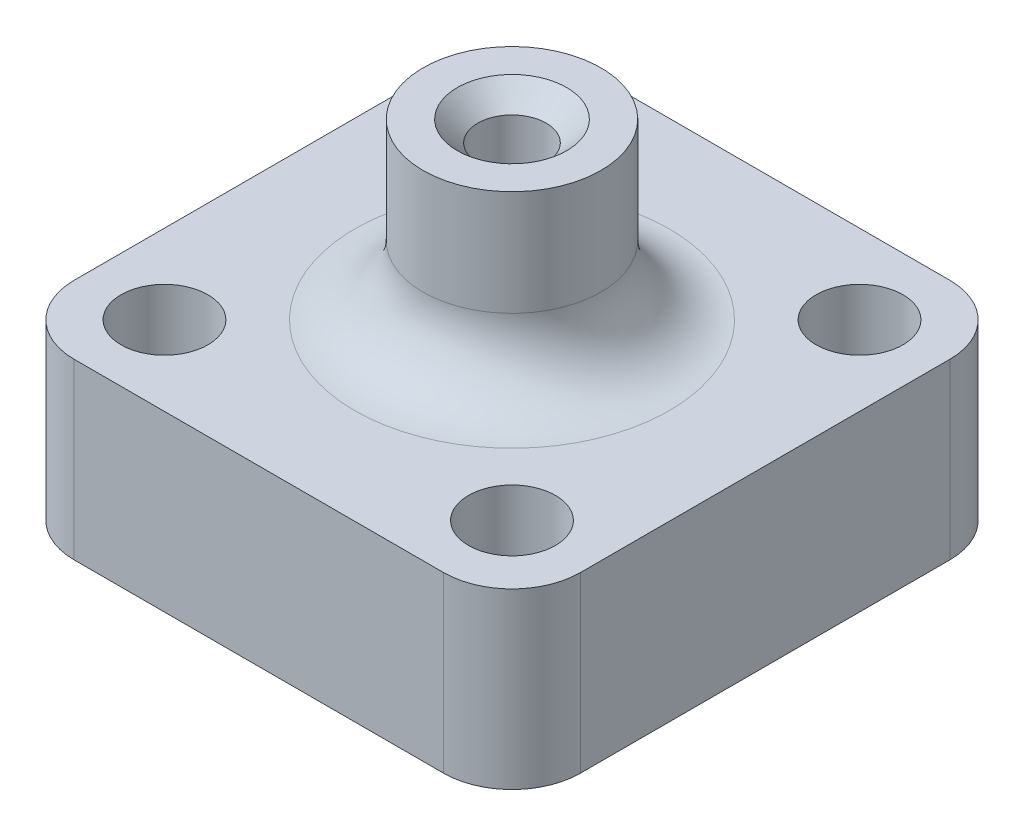
ISO-10303-21;
HEADER;
FILE_DESCRIPTION(('STEP AP214'),'2;1');
FILE_NAME('part.step','',(''),(''),'','','');
FILE_SCHEMA(('AUTOMOTIVE_DESIGN { 1 0 10303 214 1 1 1 1 }'));
ENDSEC;
DATA;
#1=APPLICATION_CONTEXT('core data for automotive mechanical design processes');
#2=APPLICATION_PROTOCOL_DEFINITION('international standard','automotive_design',2000,#1);
#3=PRODUCT_CONTEXT('',#1,'mechanical');
#4=PRODUCT('Part','Part','',(#3));
#5=PRODUCT_RELATED_PRODUCT_CATEGORY('part','',(#4));
#6=PRODUCT_DEFINITION_FORMATION('','',#4);
#7=PRODUCT_DEFINITION_CONTEXT('part definition',#1,'design');
#8=PRODUCT_DEFINITION('design','',#6,#7);
#9=PRODUCT_DEFINITION_SHAPE('','',#8);
#10=(LENGTH_UNIT() NAMED_UNIT(*) SI_UNIT(.MILLI.,.METRE.));
#11=(NAMED_UNIT(*) PLANE_ANGLE_UNIT() SI_UNIT($,.RADIAN.));
#12=(NAMED_UNIT(*) SI_UNIT($,.STERADIAN.) SOLID_ANGLE_UNIT());
#13=UNCERTAINTY_MEASURE_WITH_UNIT(LENGTH_MEASURE(1.E-05),#10,'distance_accuracy_value','');
#14=(GEOMETRIC_REPRESENTATION_CONTEXT(3) GLOBAL_UNCERTAINTY_ASSIGNED_CONTEXT((#13)) GLOBAL_UNIT_ASSIGNED_CONTEXT((#10,
#11,#12)) REPRESENTATION_CONTEXT('',''));
#15=CARTESIAN_POINT('',(0.,0.,0.));
#16=DIRECTION('',(0.,0.,1.));
#17=DIRECTION('',(1.,0.,0.));
#18=AXIS2_PLACEMENT_3D('',#15,#16,#17);
#19=CARTESIAN_POINT('',(0.,12.7,0.));
#20=DIRECTION('',(0.,1.,0.));
#21=DIRECTION('',(0.,0.,1.));
#22=AXIS2_PLACEMENT_3D('',#19,#20,#21);
#23=PLANE('',#22);
#24=CARTESIAN_POINT('',(0.,12.7,0.));
#25=DIRECTION('',(0.,1.,0.));
#26=DIRECTION('',(0.,0.,1.));
#27=AXIS2_PLACEMENT_3D('',#24,#25,#26);
#28=CIRCLE('',#27,11.5);
#29=CARTESIAN_POINT('',(0.,12.7,11.5));
#30=VERTEX_POINT('',#29);
#31=EDGE_CURVE('E144',#30,#30,#28,.F.);
#32=ORIENTED_EDGE('',*,*,#31,.T.);
#33=EDGE_LOOP('',(#32));
#34=FACE_BOUND('',#33,.T.);
#35=CARTESIAN_POINT('',(-12.7,12.7,-12.7));
#36=DIRECTION('',(0.,1.,0.));
#37=DIRECTION('',(0.,0.,1.));
#38=AXIS2_PLACEMENT_3D('',#35,#36,#37);
#39=CIRCLE('',#38,3.175);
#40=CARTESIAN_POINT('',(-12.7,12.7,-9.525));
#41=VERTEX_POINT('',#40);
#42=EDGE_CURVE('E257',#41,#41,#39,.T.);
#43=ORIENTED_EDGE('',*,*,#42,.F.);
#44=EDGE_LOOP('',(#43));
#45=FACE_BOUND('',#44,.T.);
#46=CARTESIAN_POINT('',(12.7,12.7,12.7));
#47=DIRECTION('',(0.,1.,0.));
#48=DIRECTION('',(0.,0.,1.));
#49=AXIS2_PLACEMENT_3D('',#46,#47,#48);
#50=CIRCLE('',#49,3.175);
#51=CARTESIAN_POINT('',(12.7,12.7,15.875));
#52=VERTEX_POINT('',#51);
#53=EDGE_CURVE('E246',#52,#52,#50,.T.);
#54=ORIENTED_EDGE('',*,*,#53,.F.);
#55=EDGE_LOOP('',(#54));
#56=FACE_BOUND('',#55,.T.);
#57=DIRECTION('',(-1.,0.,0.));
#58=VECTOR('',#57,1.);
#59=CARTESIAN_POINT('',(-18.5,12.7,-18.5));
#60=LINE('',#59,#58);
#61=CARTESIAN_POINT('',(13.5,12.7,-18.5));
#62=VERTEX_POINT('',#61);
#63=CARTESIAN_POINT('',(-13.5,12.7,-18.5));
#64=VERTEX_POINT('',#63);
#65=EDGE_CURVE('E228',#62,#64,#60,.T.);
#66=ORIENTED_EDGE('',*,*,#65,.T.);
#67=CARTESIAN_POINT('',(-13.5,12.7,-13.5));
#68=DIRECTION('',(0.,1.,0.));
#69=DIRECTION('',(0.,0.,1.));
#70=AXIS2_PLACEMENT_3D('',#67,#68,#69);
#71=CIRCLE('',#70,5.);
#72=CARTESIAN_POINT('',(-18.5,12.7,-13.5));
#73=VERTEX_POINT('',#72);
#74=EDGE_CURVE('E152',#64,#73,#71,.T.);
#75=ORIENTED_EDGE('',*,*,#74,.T.);
#76=DIRECTION('',(0.,0.,1.));
#77=VECTOR('',#76,1.);
#78=CARTESIAN_POINT('',(-18.5,12.7,-18.5));
#79=LINE('',#78,#77);
#80=CARTESIAN_POINT('',(-18.5,12.7,13.5));
#81=VERTEX_POINT('',#80);
#82=EDGE_CURVE('E119',#73,#81,#79,.T.);
#83=ORIENTED_EDGE('',*,*,#82,.T.);
#84=CARTESIAN_POINT('',(-13.5,12.7,13.5));
#85=DIRECTION('',(0.,1.,0.));
#86=DIRECTION('',(0.,0.,1.));
#87=AXIS2_PLACEMENT_3D('',#84,#85,#86);
#88=CIRCLE('',#87,5.);
#89=CARTESIAN_POINT('',(-13.5,12.7,18.5));
#90=VERTEX_POINT('',#89);
#91=EDGE_CURVE('E55',#81,#90,#88,.T.);
#92=ORIENTED_EDGE('',*,*,#91,.T.);
#93=DIRECTION('',(1.,0.,0.));
#94=VECTOR('',#93,1.);
#95=CARTESIAN_POINT('',(-18.5,12.7,18.5));
#96=LINE('',#95,#94);
#97=CARTESIAN_POINT('',(13.5,12.7,18.5));
#98=VERTEX_POINT('',#97);
#99=EDGE_CURVE('E135',#90,#98,#96,.T.);
#100=ORIENTED_EDGE('',*,*,#99,.T.);
#101=CARTESIAN_POINT('',(13.5,12.7,13.5));
#102=DIRECTION('',(0.,1.,0.));
#103=DIRECTION('',(0.,0.,1.));
#104=AXIS2_PLACEMENT_3D('',#101,#102,#103);
#105=CIRCLE('',#104,5.);
#106=CARTESIAN_POINT('',(18.5,12.7,13.5));
#107=VERTEX_POINT('',#106);
#108=EDGE_CURVE('E148',#98,#107,#105,.T.);
#109=ORIENTED_EDGE('',*,*,#108,.T.);
#110=DIRECTION('',(0.,0.,-1.));
#111=VECTOR('',#110,1.);
#112=CARTESIAN_POINT('',(18.5,12.7,-18.5));
#113=LINE('',#112,#111);
#114=CARTESIAN_POINT('',(18.5,12.7,-13.5));
#115=VERTEX_POINT('',#114);
#116=EDGE_CURVE('E129',#107,#115,#113,.T.);
#117=ORIENTED_EDGE('',*,*,#116,.T.);
#118=CARTESIAN_POINT('',(13.5,12.7,-13.5));
#119=DIRECTION('',(0.,1.,0.));
#120=DIRECTION('',(0.,0.,1.));
#121=AXIS2_PLACEMENT_3D('',#118,#119,#120);
#122=CIRCLE('',#121,5.);
#123=EDGE_CURVE('E150',#115,#62,#122,.T.);
#124=ORIENTED_EDGE('',*,*,#123,.T.);
#125=EDGE_LOOP('',(#66,#75,#83,#92,#100,#109,#117,#124));
#126=FACE_BOUND('',#125,.T.);
#127=CARTESIAN_POINT('',(-12.7,12.7,12.7));
#128=DIRECTION('',(0.,1.,0.));
#129=DIRECTION('',(0.,0.,1.));
#130=AXIS2_PLACEMENT_3D('',#127,#128,#129);
#131=CIRCLE('',#130,3.175);
#132=CARTESIAN_POINT('',(-12.7,12.7,15.875));
#133=VERTEX_POINT('',#132);
#134=EDGE_CURVE('E238',#133,#133,#131,.T.);
#135=ORIENTED_EDGE('',*,*,#134,.F.);
#136=EDGE_LOOP('',(#135));
#137=FACE_BOUND('',#136,.T.);
#138=CARTESIAN_POINT('',(12.7,12.7,-12.7));
#139=DIRECTION('',(0.,1.,0.));
#140=DIRECTION('',(0.,0.,1.));
#141=AXIS2_PLACEMENT_3D('',#138,#139,#140);
#142=CIRCLE('',#141,3.175);
#143=CARTESIAN_POINT('',(12.7,12.7,-9.525));
#144=VERTEX_POINT('',#143);
#145=EDGE_CURVE('E251',#144,#144,#142,.T.);
#146=ORIENTED_EDGE('',*,*,#145,.F.);
#147=EDGE_LOOP('',(#146));
#148=FACE_BOUND('',#147,.T.);
#149=ADVANCED_FACE('F33',(#34,#45,#56,#126,#137,#148),#23,.T.);
#150=CARTESIAN_POINT('',(0.,0.,0.));
#151=DIRECTION('',(0.,1.,0.));
#152=DIRECTION('',(0.,0.,1.));
#153=AXIS2_PLACEMENT_3D('',#150,#151,#152);
#154=PLANE('',#153);
#155=DIRECTION('',(0.,0.,1.));
#156=VECTOR('',#155,1.);
#157=CARTESIAN_POINT('',(-18.5,0.,-18.5));
#158=LINE('',#157,#156);
#159=CARTESIAN_POINT('',(-18.5,0.,-13.5));
#160=VERTEX_POINT('',#159);
#161=CARTESIAN_POINT('',(-18.5,0.,13.5));
#162=VERTEX_POINT('',#161);
#163=EDGE_CURVE('E117',#160,#162,#158,.T.);
#164=ORIENTED_EDGE('',*,*,#163,.F.);
#165=CARTESIAN_POINT('',(-13.5,0.,-13.5));
#166=DIRECTION('',(0.,1.,0.));
#167=DIRECTION('',(0.,0.,1.));
#168=AXIS2_PLACEMENT_3D('',#165,#166,#167);
#169=CIRCLE('',#168,5.);
#170=CARTESIAN_POINT('',(-13.5,0.,-18.5));
#171=VERTEX_POINT('',#170);
#172=EDGE_CURVE('E100',#160,#171,#169,.F.);
#173=ORIENTED_EDGE('',*,*,#172,.T.);
#174=DIRECTION('',(-1.,0.,0.));
#175=VECTOR('',#174,1.);
#176=CARTESIAN_POINT('',(-18.5,0.,-18.5));
#177=LINE('',#176,#175);
#178=CARTESIAN_POINT('',(13.5,0.,-18.5));
#179=VERTEX_POINT('',#178);
#180=EDGE_CURVE('E127',#179,#171,#177,.T.);
#181=ORIENTED_EDGE('',*,*,#180,.F.);
#182=CARTESIAN_POINT('',(13.5,0.,-13.5));
#183=DIRECTION('',(0.,1.,0.));
#184=DIRECTION('',(0.,0.,1.));
#185=AXIS2_PLACEMENT_3D('',#182,#183,#184);
#186=CIRCLE('',#185,5.);
#187=CARTESIAN_POINT('',(18.5,0.,-13.5));
#188=VERTEX_POINT('',#187);
#189=EDGE_CURVE('E111',#179,#188,#186,.F.);
#190=ORIENTED_EDGE('',*,*,#189,.T.);
#191=DIRECTION('',(0.,0.,-1.));
#192=VECTOR('',#191,1.);
#193=CARTESIAN_POINT('',(18.5,0.,-18.5));
#194=LINE('',#193,#192);
#195=CARTESIAN_POINT('',(18.5,0.,13.5));
#196=VERTEX_POINT('',#195);
#197=EDGE_CURVE('E131',#196,#188,#194,.T.);
#198=ORIENTED_EDGE('',*,*,#197,.F.);
#199=CARTESIAN_POINT('',(13.5,0.,13.5));
#200=DIRECTION('',(0.,1.,0.));
#201=DIRECTION('',(0.,0.,1.));
#202=AXIS2_PLACEMENT_3D('',#199,#200,#201);
#203=CIRCLE('',#202,5.);
#204=CARTESIAN_POINT('',(13.5,0.,18.5));
#205=VERTEX_POINT('',#204);
#206=EDGE_CURVE('E138',#196,#205,#203,.F.);
#207=ORIENTED_EDGE('',*,*,#206,.T.);
#208=DIRECTION('',(1.,0.,0.));
#209=VECTOR('',#208,1.);
#210=CARTESIAN_POINT('',(-18.5,0.,18.5));
#211=LINE('',#210,#209);
#212=CARTESIAN_POINT('',(-13.5,0.,18.5));
#213=VERTEX_POINT('',#212);
#214=EDGE_CURVE('E126',#213,#205,#211,.T.);
#215=ORIENTED_EDGE('',*,*,#214,.F.);
#216=CARTESIAN_POINT('',(-13.5,0.,13.5));
#217=DIRECTION('',(0.,1.,0.));
#218=DIRECTION('',(0.,0.,1.));
#219=AXIS2_PLACEMENT_3D('',#216,#217,#218);
#220=CIRCLE('',#219,5.);
#221=EDGE_CURVE('E120',#213,#162,#220,.F.);
#222=ORIENTED_EDGE('',*,*,#221,.T.);
#223=EDGE_LOOP('',(#164,#173,#181,#190,#198,#207,#215,#222));
#224=FACE_BOUND('',#223,.T.);
#225=CARTESIAN_POINT('',(0.,0.,0.));
#226=DIRECTION('',(0.,1.,0.));
#227=DIRECTION('',(0.,0.,1.));
#228=AXIS2_PLACEMENT_3D('',#225,#226,#227);
#229=CIRCLE('',#228,2.5);
#230=CARTESIAN_POINT('',(0.,0.,2.5));
#231=VERTEX_POINT('',#230);
#232=EDGE_CURVE('E233',#231,#231,#229,.T.);
#233=ORIENTED_EDGE('',*,*,#232,.T.);
#234=EDGE_LOOP('',(#233));
#235=FACE_BOUND('',#234,.T.);
#236=CARTESIAN_POINT('',(-12.7,0.,12.7));
#237=DIRECTION('',(0.,1.,0.));
#238=DIRECTION('',(0.,0.,1.));
#239=AXIS2_PLACEMENT_3D('',#236,#237,#238);
#240=CIRCLE('',#239,3.175);
#241=CARTESIAN_POINT('',(-12.7,0.,15.875));
#242=VERTEX_POINT('',#241);
#243=EDGE_CURVE('E241',#242,#242,#240,.T.);
#244=ORIENTED_EDGE('',*,*,#243,.T.);
#245=EDGE_LOOP('',(#244));
#246=FACE_BOUND('',#245,.T.);
#247=CARTESIAN_POINT('',(12.7,0.,12.7));
#248=DIRECTION('',(0.,1.,0.));
#249=DIRECTION('',(0.,0.,1.));
#250=AXIS2_PLACEMENT_3D('',#247,#248,#249);
#251=CIRCLE('',#250,3.175);
#252=CARTESIAN_POINT('',(12.7,0.,15.875));
#253=VERTEX_POINT('',#252);
#254=EDGE_CURVE('E248',#253,#253,#251,.T.);
#255=ORIENTED_EDGE('',*,*,#254,.T.);
#256=EDGE_LOOP('',(#255));
#257=FACE_BOUND('',#256,.T.);
#258=CARTESIAN_POINT('',(12.7,0.,-12.7));
#259=DIRECTION('',(0.,1.,0.));
#260=DIRECTION('',(0.,0.,1.));
#261=AXIS2_PLACEMENT_3D('',#258,#259,#260);
#262=CIRCLE('',#261,3.175);
#263=CARTESIAN_POINT('',(12.7,0.,-9.525));
#264=VERTEX_POINT('',#263);
#265=EDGE_CURVE('E254',#264,#264,#262,.T.);
#266=ORIENTED_EDGE('',*,*,#265,.T.);
#267=EDGE_LOOP('',(#266));
#268=FACE_BOUND('',#267,.T.);
#269=CARTESIAN_POINT('',(-12.7,0.,-12.7));
#270=DIRECTION('',(0.,1.,0.));
#271=DIRECTION('',(0.,0.,1.));
#272=AXIS2_PLACEMENT_3D('',#269,#270,#271);
#273=CIRCLE('',#272,3.175);
#274=CARTESIAN_POINT('',(-12.7,0.,-9.525));
#275=VERTEX_POINT('',#274);
#276=EDGE_CURVE('E260',#275,#275,#273,.T.);
#277=ORIENTED_EDGE('',*,*,#276,.T.);
#278=EDGE_LOOP('',(#277));
#279=FACE_BOUND('',#278,.T.);
#280=ADVANCED_FACE('F123',(#224,#235,#246,#257,#268,#279),#154,.F.);
#281=CARTESIAN_POINT('',(18.5,12.7,-18.5));
#282=DIRECTION('',(-1.,0.,0.));
#283=DIRECTION('',(0.,0.,1.));
#284=AXIS2_PLACEMENT_3D('',#281,#282,#283);
#285=PLANE('',#284);
#286=ORIENTED_EDGE('',*,*,#197,.T.);
#287=DIRECTION('',(0.,-1.,0.));
#288=VECTOR('',#287,1.);
#289=CARTESIAN_POINT('',(18.5,12.7,-13.5));
#290=LINE('',#289,#288);
#291=EDGE_CURVE('E157',#188,#115,#290,.F.);
#292=ORIENTED_EDGE('',*,*,#291,.T.);
#293=ORIENTED_EDGE('',*,*,#116,.F.);
#294=DIRECTION('',(0.,-1.,0.));
#295=VECTOR('',#294,1.);
#296=CARTESIAN_POINT('',(18.5,12.7,13.5));
#297=LINE('',#296,#295);
#298=EDGE_CURVE('E154',#107,#196,#297,.T.);
#299=ORIENTED_EDGE('',*,*,#298,.T.);
#300=EDGE_LOOP('',(#286,#292,#293,#299));
#301=FACE_BOUND('',#300,.T.);
#302=ADVANCED_FACE('F186',(#301),#285,.F.);
#303=CARTESIAN_POINT('',(-18.5,12.7,-18.5));
#304=DIRECTION('',(0.,0.,1.));
#305=DIRECTION('',(1.,0.,0.));
#306=AXIS2_PLACEMENT_3D('',#303,#304,#305);
#307=PLANE('',#306);
#308=ORIENTED_EDGE('',*,*,#180,.T.);
#309=DIRECTION('',(0.,-1.,0.));
#310=VECTOR('',#309,1.);
#311=CARTESIAN_POINT('',(-13.5,12.7,-18.5));
#312=LINE('',#311,#310);
#313=EDGE_CURVE('E105',#171,#64,#312,.F.);
#314=ORIENTED_EDGE('',*,*,#313,.T.);
#315=ORIENTED_EDGE('',*,*,#65,.F.);
#316=DIRECTION('',(0.,-1.,0.));
#317=VECTOR('',#316,1.);
#318=CARTESIAN_POINT('',(13.5,12.7,-18.5));
#319=LINE('',#318,#317);
#320=EDGE_CURVE('E110',#62,#179,#319,.T.);
#321=ORIENTED_EDGE('',*,*,#320,.T.);
#322=EDGE_LOOP('',(#308,#314,#315,#321));
#323=FACE_BOUND('',#322,.T.);
#324=ADVANCED_FACE('F197',(#323),#307,.F.);
#325=CARTESIAN_POINT('',(-18.5,12.7,-18.5));
#326=DIRECTION('',(1.,0.,0.));
#327=DIRECTION('',(0.,0.,-1.));
#328=AXIS2_PLACEMENT_3D('',#325,#326,#327);
#329=PLANE('',#328);
#330=ORIENTED_EDGE('',*,*,#82,.F.);
#331=DIRECTION('',(0.,-1.,0.));
#332=VECTOR('',#331,1.);
#333=CARTESIAN_POINT('',(-18.5,12.7,-13.5));
#334=LINE('',#333,#332);
#335=EDGE_CURVE('E104',#73,#160,#334,.T.);
#336=ORIENTED_EDGE('',*,*,#335,.T.);
#337=ORIENTED_EDGE('',*,*,#163,.T.);
#338=DIRECTION('',(0.,-1.,0.));
#339=VECTOR('',#338,1.);
#340=CARTESIAN_POINT('',(-18.5,12.7,13.5));
#341=LINE('',#340,#339);
#342=EDGE_CURVE('E121',#162,#81,#341,.F.);
#343=ORIENTED_EDGE('',*,*,#342,.T.);
#344=EDGE_LOOP('',(#330,#336,#337,#343));
#345=FACE_BOUND('',#344,.T.);
#346=ADVANCED_FACE('F116',(#345),#329,.F.);
#347=CARTESIAN_POINT('',(-18.5,12.7,18.5));
#348=DIRECTION('',(0.,0.,-1.));
#349=DIRECTION('',(-1.,0.,0.));
#350=AXIS2_PLACEMENT_3D('',#347,#348,#349);
#351=PLANE('',#350);
#352=ORIENTED_EDGE('',*,*,#214,.T.);
#353=DIRECTION('',(0.,-1.,0.));
#354=VECTOR('',#353,1.);
#355=CARTESIAN_POINT('',(13.5,12.7,18.5));
#356=LINE('',#355,#354);
#357=EDGE_CURVE('E48',#205,#98,#356,.F.);
#358=ORIENTED_EDGE('',*,*,#357,.T.);
#359=ORIENTED_EDGE('',*,*,#99,.F.);
#360=DIRECTION('',(0.,-1.,0.));
#361=VECTOR('',#360,1.);
#362=CARTESIAN_POINT('',(-13.5,12.7,18.5));
#363=LINE('',#362,#361);
#364=EDGE_CURVE('E159',#90,#213,#363,.T.);
#365=ORIENTED_EDGE('',*,*,#364,.T.);
#366=EDGE_LOOP('',(#352,#358,#359,#365));
#367=FACE_BOUND('',#366,.T.);
#368=ADVANCED_FACE('F192',(#367),#351,.F.);
#369=CARTESIAN_POINT('',(0.,12.7,0.));
#370=DIRECTION('',(0.,-1.,0.));
#371=DIRECTION('',(0.,0.,-1.));
#372=AXIS2_PLACEMENT_3D('',#369,#370,#371);
#373=CYLINDRICAL_SURFACE('',#372,2.5);
#374=CARTESIAN_POINT('',(0.,23.9,0.));
#375=DIRECTION('',(0.,1.,0.));
#376=DIRECTION('',(0.,0.,1.));
#377=AXIS2_PLACEMENT_3D('',#374,#375,#376);
#378=CIRCLE('',#377,2.5);
#379=CARTESIAN_POINT('',(0.,23.9,2.5));
#380=VERTEX_POINT('',#379);
#381=EDGE_CURVE('E41',#380,#380,#378,.T.);
#382=ORIENTED_EDGE('',*,*,#381,.T.);
#383=EDGE_LOOP('',(#382));
#384=FACE_BOUND('',#383,.T.);
#385=ORIENTED_EDGE('',*,*,#232,.F.);
#386=EDGE_LOOP('',(#385));
#387=FACE_BOUND('',#386,.T.);
#388=ADVANCED_FACE('F168',(#384,#387),#373,.F.);
#389=CARTESIAN_POINT('',(-12.7,12.7,12.7));
#390=DIRECTION('',(0.,-1.,0.));
#391=DIRECTION('',(0.,0.,-1.));
#392=AXIS2_PLACEMENT_3D('',#389,#390,#391);
#393=CYLINDRICAL_SURFACE('',#392,3.175);
#394=ORIENTED_EDGE('',*,*,#134,.T.);
#395=EDGE_LOOP('',(#394));
#396=FACE_BOUND('',#395,.T.);
#397=ORIENTED_EDGE('',*,*,#243,.F.);
#398=EDGE_LOOP('',(#397));
#399=FACE_BOUND('',#398,.T.);
#400=ADVANCED_FACE('F290',(#396,#399),#393,.F.);
#401=CARTESIAN_POINT('',(12.7,12.7,12.7));
#402=DIRECTION('',(0.,-1.,0.));
#403=DIRECTION('',(0.,0.,-1.));
#404=AXIS2_PLACEMENT_3D('',#401,#402,#403);
#405=CYLINDRICAL_SURFACE('',#404,3.175);
#406=ORIENTED_EDGE('',*,*,#53,.T.);
#407=EDGE_LOOP('',(#406));
#408=FACE_BOUND('',#407,.T.);
#409=ORIENTED_EDGE('',*,*,#254,.F.);
#410=EDGE_LOOP('',(#409));
#411=FACE_BOUND('',#410,.T.);
#412=ADVANCED_FACE('F287',(#408,#411),#405,.F.);
#413=CARTESIAN_POINT('',(12.7,12.7,-12.7));
#414=DIRECTION('',(0.,-1.,0.));
#415=DIRECTION('',(0.,0.,-1.));
#416=AXIS2_PLACEMENT_3D('',#413,#414,#415);
#417=CYLINDRICAL_SURFACE('',#416,3.175);
#418=ORIENTED_EDGE('',*,*,#145,.T.);
#419=EDGE_LOOP('',(#418));
#420=FACE_BOUND('',#419,.T.);
#421=ORIENTED_EDGE('',*,*,#265,.F.);
#422=EDGE_LOOP('',(#421));
#423=FACE_BOUND('',#422,.T.);
#424=ADVANCED_FACE('F283',(#420,#423),#417,.F.);
#425=CARTESIAN_POINT('',(-12.7,12.7,-12.7));
#426=DIRECTION('',(0.,-1.,0.));
#427=DIRECTION('',(0.,0.,-1.));
#428=AXIS2_PLACEMENT_3D('',#425,#426,#427);
#429=CYLINDRICAL_SURFACE('',#428,3.175);
#430=ORIENTED_EDGE('',*,*,#42,.T.);
#431=EDGE_LOOP('',(#430));
#432=FACE_BOUND('',#431,.T.);
#433=ORIENTED_EDGE('',*,*,#276,.F.);
#434=EDGE_LOOP('',(#433));
#435=FACE_BOUND('',#434,.T.);
#436=ADVANCED_FACE('F277',(#432,#435),#429,.F.);
#437=CARTESIAN_POINT('',(0.,25.4,0.));
#438=DIRECTION('',(0.,1.,0.));
#439=DIRECTION('',(0.,0.,1.));
#440=AXIS2_PLACEMENT_3D('',#437,#438,#439);
#441=PLANE('',#440);
#442=CARTESIAN_POINT('',(0.,25.4,0.));
#443=DIRECTION('',(0.,1.,0.));
#444=DIRECTION('',(0.,0.,1.));
#445=AXIS2_PLACEMENT_3D('',#442,#443,#444);
#446=CIRCLE('',#445,4.00000000000001);
#447=CARTESIAN_POINT('',(0.,25.4,4.00000000000001));
#448=VERTEX_POINT('',#447);
#449=EDGE_CURVE('E11',#448,#448,#446,.F.);
#450=ORIENTED_EDGE('',*,*,#449,.T.);
#451=EDGE_LOOP('',(#450));
#452=FACE_BOUND('',#451,.T.);
#453=CARTESIAN_POINT('',(0.,25.4,0.));
#454=DIRECTION('',(0.,1.,0.));
#455=DIRECTION('',(0.,0.,1.));
#456=AXIS2_PLACEMENT_3D('',#453,#454,#455);
#457=CIRCLE('',#456,6.5);
#458=CARTESIAN_POINT('',(0.,25.4,6.5));
#459=VERTEX_POINT('',#458);
#460=EDGE_CURVE('E263',#459,#459,#457,.T.);
#461=ORIENTED_EDGE('',*,*,#460,.T.);
#462=EDGE_LOOP('',(#461));
#463=FACE_BOUND('',#462,.T.);
#464=ADVANCED_FACE('F269',(#452,#463),#441,.T.);
#465=CARTESIAN_POINT('',(0.,25.4,0.));
#466=DIRECTION('',(0.,-1.,0.));
#467=DIRECTION('',(0.,0.,-1.));
#468=AXIS2_PLACEMENT_3D('',#465,#466,#467);
#469=CYLINDRICAL_SURFACE('',#468,6.5);
#470=CARTESIAN_POINT('',(0.,17.7,0.));
#471=DIRECTION('',(0.,1.,0.));
#472=DIRECTION('',(0.,0.,1.));
#473=AXIS2_PLACEMENT_3D('',#470,#471,#472);
#474=CIRCLE('',#473,6.5);
#475=CARTESIAN_POINT('',(0.,17.7,6.5));
#476=VERTEX_POINT('',#475);
#477=EDGE_CURVE('E163',#476,#476,#474,.T.);
#478=ORIENTED_EDGE('',*,*,#477,.T.);
#479=EDGE_LOOP('',(#478));
#480=FACE_BOUND('',#479,.T.);
#481=ORIENTED_EDGE('',*,*,#460,.F.);
#482=EDGE_LOOP('',(#481));
#483=FACE_BOUND('',#482,.T.);
#484=ADVANCED_FACE('F207',(#480,#483),#469,.T.);
#485=CARTESIAN_POINT('',(-13.5,12.7,-13.5));
#486=DIRECTION('',(0.,-1.,0.));
#487=DIRECTION('',(0.,0.,-1.));
#488=AXIS2_PLACEMENT_3D('',#485,#486,#487);
#489=CYLINDRICAL_SURFACE('',#488,5.);
#490=ORIENTED_EDGE('',*,*,#74,.F.);
#491=ORIENTED_EDGE('',*,*,#313,.F.);
#492=ORIENTED_EDGE('',*,*,#172,.F.);
#493=ORIENTED_EDGE('',*,*,#335,.F.);
#494=EDGE_LOOP('',(#490,#491,#492,#493));
#495=FACE_BOUND('',#494,.T.);
#496=ADVANCED_FACE('F103',(#495),#489,.T.);
#497=CARTESIAN_POINT('',(13.5,12.7,-13.5));
#498=DIRECTION('',(0.,-1.,0.));
#499=DIRECTION('',(0.,0.,-1.));
#500=AXIS2_PLACEMENT_3D('',#497,#498,#499);
#501=CYLINDRICAL_SURFACE('',#500,5.);
#502=ORIENTED_EDGE('',*,*,#123,.F.);
#503=ORIENTED_EDGE('',*,*,#291,.F.);
#504=ORIENTED_EDGE('',*,*,#189,.F.);
#505=ORIENTED_EDGE('',*,*,#320,.F.);
#506=EDGE_LOOP('',(#502,#503,#504,#505));
#507=FACE_BOUND('',#506,.T.);
#508=ADVANCED_FACE('F206',(#507),#501,.T.);
#509=CARTESIAN_POINT('',(13.5,12.7,13.5));
#510=DIRECTION('',(0.,-1.,0.));
#511=DIRECTION('',(0.,0.,-1.));
#512=AXIS2_PLACEMENT_3D('',#509,#510,#511);
#513=CYLINDRICAL_SURFACE('',#512,5.);
#514=ORIENTED_EDGE('',*,*,#108,.F.);
#515=ORIENTED_EDGE('',*,*,#357,.F.);
#516=ORIENTED_EDGE('',*,*,#206,.F.);
#517=ORIENTED_EDGE('',*,*,#298,.F.);
#518=EDGE_LOOP('',(#514,#515,#516,#517));
#519=FACE_BOUND('',#518,.T.);
#520=ADVANCED_FACE('F210',(#519),#513,.T.);
#521=CARTESIAN_POINT('',(-13.5,12.7,13.5));
#522=DIRECTION('',(0.,-1.,0.));
#523=DIRECTION('',(0.,0.,-1.));
#524=AXIS2_PLACEMENT_3D('',#521,#522,#523);
#525=CYLINDRICAL_SURFACE('',#524,5.);
#526=ORIENTED_EDGE('',*,*,#91,.F.);
#527=ORIENTED_EDGE('',*,*,#342,.F.);
#528=ORIENTED_EDGE('',*,*,#221,.F.);
#529=ORIENTED_EDGE('',*,*,#364,.F.);
#530=EDGE_LOOP('',(#526,#527,#528,#529));
#531=FACE_BOUND('',#530,.T.);
#532=ADVANCED_FACE('F177',(#531),#525,.T.);
#533=CARTESIAN_POINT('',(0.,17.7,0.));
#534=DIRECTION('',(0.,1.,0.));
#535=DIRECTION('',(0.,0.,1.));
#536=AXIS2_PLACEMENT_3D('',#533,#534,#535);
#537=TOROIDAL_SURFACE('',#536,11.5,5.);
#538=ORIENTED_EDGE('',*,*,#31,.F.);
#539=EDGE_LOOP('',(#538));
#540=FACE_BOUND('',#539,.T.);
#541=ORIENTED_EDGE('',*,*,#477,.F.);
#542=EDGE_LOOP('',(#541));
#543=FACE_BOUND('',#542,.T.);
#544=ADVANCED_FACE('F172',(#540,#543),#537,.F.);
#545=CARTESIAN_POINT('',(0.,23.9,0.));
#546=DIRECTION('',(0.,1.,0.));
#547=DIRECTION('',(0.,0.,1.));
#548=AXIS2_PLACEMENT_3D('',#545,#546,#547);
#549=CONICAL_SURFACE('',#548,2.5,0.785398163397452);
#550=ORIENTED_EDGE('',*,*,#449,.F.);
#551=EDGE_LOOP('',(#550));
#552=FACE_BOUND('',#551,.T.);
#553=ORIENTED_EDGE('',*,*,#381,.F.);
#554=EDGE_LOOP('',(#553));
#555=FACE_BOUND('',#554,.T.);
#556=ADVANCED_FACE('F35',(#552,#555),#549,.F.);
#557=CLOSED_SHELL('',(#149,#280,#302,#324,#346,#368,#388,#400,#412,#424,#436,#464,#484,#496,
#508,#520,#532,#544,#556));
#558=MANIFOLD_SOLID_BREP('B2',#557);
#559=ADVANCED_BREP_SHAPE_REPRESENTATION('',(#18,#558),#14);
#560=SHAPE_DEFINITION_REPRESENTATION(#9,#559);
ENDSEC;
END-ISO-10303-21;
